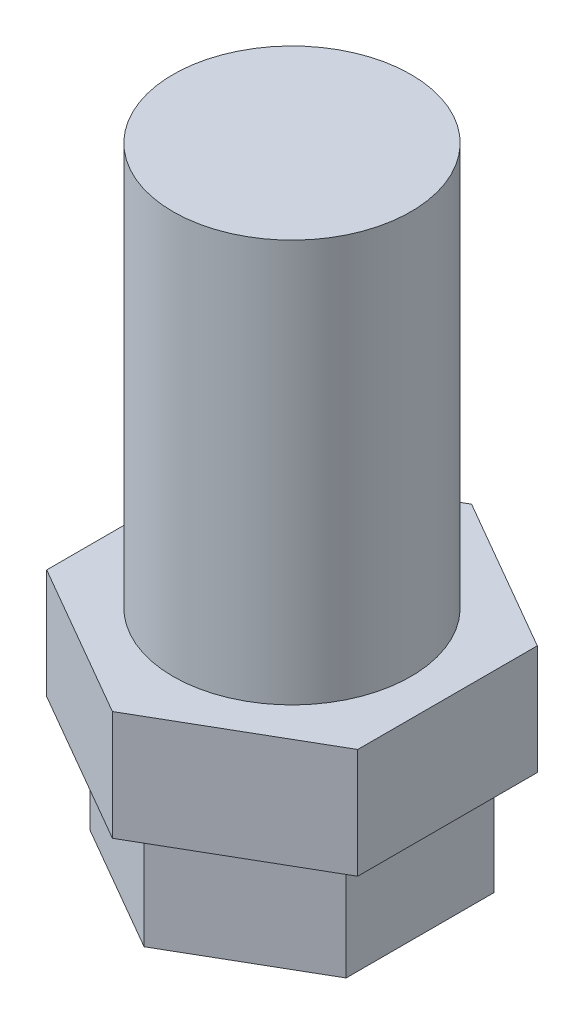
ISO-10303-21;
HEADER;
FILE_DESCRIPTION(('STEP AP214'),'2;1');
FILE_NAME('part.step','',(''),(''),'','','');
FILE_SCHEMA(('AUTOMOTIVE_DESIGN { 1 0 10303 214 1 1 1 1 }'));
ENDSEC;
DATA;
#1=APPLICATION_CONTEXT('core data for automotive mechanical design processes');
#2=APPLICATION_PROTOCOL_DEFINITION('international standard','automotive_design',2000,#1);
#3=PRODUCT_CONTEXT('',#1,'mechanical');
#4=PRODUCT('Part','Part','',(#3));
#5=PRODUCT_RELATED_PRODUCT_CATEGORY('part','',(#4));
#6=PRODUCT_DEFINITION_FORMATION('','',#4);
#7=PRODUCT_DEFINITION_CONTEXT('part definition',#1,'design');
#8=PRODUCT_DEFINITION('design','',#6,#7);
#9=PRODUCT_DEFINITION_SHAPE('','',#8);
#10=(LENGTH_UNIT() NAMED_UNIT(*) SI_UNIT(.MILLI.,.METRE.));
#11=(NAMED_UNIT(*) PLANE_ANGLE_UNIT() SI_UNIT($,.RADIAN.));
#12=(NAMED_UNIT(*) SI_UNIT($,.STERADIAN.) SOLID_ANGLE_UNIT());
#13=UNCERTAINTY_MEASURE_WITH_UNIT(LENGTH_MEASURE(1.E-05),#10,'distance_accuracy_value','');
#14=(GEOMETRIC_REPRESENTATION_CONTEXT(3) GLOBAL_UNCERTAINTY_ASSIGNED_CONTEXT((#13)) GLOBAL_UNIT_ASSIGNED_CONTEXT((#10,
#11,#12)) REPRESENTATION_CONTEXT('',''));
#15=CARTESIAN_POINT('',(0.,0.,0.));
#16=DIRECTION('',(0.,0.,1.));
#17=DIRECTION('',(1.,0.,0.));
#18=AXIS2_PLACEMENT_3D('',#15,#16,#17);
#19=CARTESIAN_POINT('',(-5.66056250653227E-05,39.3810771161219,5.49030475094835E-11));
#20=DIRECTION('',(1.43738133160636E-06,-0.999999999998967,-1.3941479393145E-12));
#21=DIRECTION('',(0.999999999998967,1.43738133160636E-06,0.));
#22=AXIS2_PLACEMENT_3D('',#19,#20,#21);
#23=PLANE('',#22);
#24=DIRECTION('',(-0.866025403783546,-1.24480944517059E-06,0.5));
#25=VECTOR('',#24,1.);
#26=CARTESIAN_POINT('',(176.249913797421,39.3813304544609,56.0321742847801));
#27=LINE('',#26,#25);
#28=CARTESIAN_POINT('',(176.249913797421,39.3813304544609,56.0321742847801));
#29=VERTEX_POINT('',#28);
#30=CARTESIAN_POINT('',(171.999913797425,39.3813243455868,58.485912928836));
#31=VERTEX_POINT('',#30);
#32=EDGE_CURVE('E116',#29,#31,#27,.T.);
#33=ORIENTED_EDGE('',*,*,#32,.F.);
#34=DIRECTION('',(0.,-1.39414794762809E-12,1.));
#35=VECTOR('',#34,1.);
#36=CARTESIAN_POINT('',(176.249913797421,39.3813304544678,51.1246969966684));
#37=LINE('',#36,#35);
#38=CARTESIAN_POINT('',(176.249913797421,39.3813304544678,51.1246969966685));
#39=VERTEX_POINT('',#38);
#40=EDGE_CURVE('E126',#39,#29,#37,.T.);
#41=ORIENTED_EDGE('',*,*,#40,.F.);
#42=DIRECTION('',(0.866025403783548,1.2448080496087E-06,0.499999999999994));
#43=VECTOR('',#42,1.);
#44=CARTESIAN_POINT('',(171.999913797425,39.3813243456006,48.6709583526126));
#45=LINE('',#44,#43);
#46=CARTESIAN_POINT('',(171.999913797425,39.3813243456006,48.6709583526125));
#47=VERTEX_POINT('',#46);
#48=EDGE_CURVE('E70',#47,#39,#45,.T.);
#49=ORIENTED_EDGE('',*,*,#48,.F.);
#50=DIRECTION('',(0.866025403783544,1.2448094451706E-06,-0.5));
#51=VECTOR('',#50,1.);
#52=CARTESIAN_POINT('',(167.74991379743,39.3813182367265,51.1246969966684));
#53=LINE('',#52,#51);
#54=CARTESIAN_POINT('',(167.74991379743,39.3813182367265,51.124696996668));
#55=VERTEX_POINT('',#54);
#56=EDGE_CURVE('E123',#55,#47,#53,.T.);
#57=ORIENTED_EDGE('',*,*,#56,.F.);
#58=DIRECTION('',(0.,1.39273400447633E-12,-1.));
#59=VECTOR('',#58,1.);
#60=CARTESIAN_POINT('',(167.74991379743,39.3813182367196,56.0321742847798));
#61=LINE('',#60,#59);
#62=CARTESIAN_POINT('',(167.74991379743,39.3813182367196,56.0321742847801));
#63=VERTEX_POINT('',#62);
#64=EDGE_CURVE('E104',#63,#55,#61,.T.);
#65=ORIENTED_EDGE('',*,*,#64,.F.);
#66=DIRECTION('',(-0.866025403783545,-1.24480805102265E-06,-0.5));
#67=VECTOR('',#66,1.);
#68=CARTESIAN_POINT('',(171.999913797425,39.3813243455868,58.485912928836));
#69=LINE('',#68,#67);
#70=EDGE_CURVE('E119',#31,#63,#69,.T.);
#71=ORIENTED_EDGE('',*,*,#70,.F.);
#72=EDGE_LOOP('',(#33,#41,#49,#57,#65,#71));
#73=FACE_BOUND('',#72,.T.);
#74=CARTESIAN_POINT('',(171.999913797425,39.3813243486702,53.5784356407242));
#75=DIRECTION('',(-1.43738133160636E-06,0.999999999998967,1.39414793936096E-12));
#76=DIRECTION('',(0.,1.39414793957272E-12,-1.));
#77=AXIS2_PLACEMENT_3D('',#74,#75,#76);
#78=CIRCLE('',#77,3.25);
#79=CARTESIAN_POINT('',(171.999913797425,39.3813243486748,50.3284356407242));
#80=VERTEX_POINT('',#79);
#81=EDGE_CURVE('E11',#80,#80,#78,.T.);
#82=ORIENTED_EDGE('',*,*,#81,.F.);
#83=EDGE_LOOP('',(#82));
#84=FACE_BOUND('',#83,.T.);
#85=ADVANCED_FACE('F17',(#73,#84),#23,.F.);
#86=CARTESIAN_POINT('',(-5.22934810733301E-05,36.381077116125,5.07209228912537E-11));
#87=DIRECTION('',(1.43738133160636E-06,-0.999999999998967,-1.3941479393145E-12));
#88=DIRECTION('',(0.999999999998967,1.43738133160636E-06,0.));
#89=AXIS2_PLACEMENT_3D('',#86,#87,#88);
#90=PLANE('',#89);
#91=DIRECTION('',(-0.866025403783546,-1.24480944517059E-06,0.5));
#92=VECTOR('',#91,1.);
#93=CARTESIAN_POINT('',(176.249918109565,36.3813304544641,56.0321742847759));
#94=LINE('',#93,#92);
#95=CARTESIAN_POINT('',(176.249918109565,36.3813304544641,56.0321742847759));
#96=VERTEX_POINT('',#95);
#97=CARTESIAN_POINT('',(171.999918109569,36.3813243455899,58.4859129288318));
#98=VERTEX_POINT('',#97);
#99=EDGE_CURVE('E128',#96,#98,#94,.T.);
#100=ORIENTED_EDGE('',*,*,#99,.T.);
#101=DIRECTION('',(-0.866025403783545,-1.24480805102265E-06,-0.5));
#102=VECTOR('',#101,1.);
#103=CARTESIAN_POINT('',(171.999918109569,36.3813243455899,58.4859129288319));
#104=LINE('',#103,#102);
#105=CARTESIAN_POINT('',(167.749918109574,36.3813182367227,56.032174284776));
#106=VERTEX_POINT('',#105);
#107=EDGE_CURVE('E95',#98,#106,#104,.T.);
#108=ORIENTED_EDGE('',*,*,#107,.T.);
#109=DIRECTION('',(0.,1.39273400447633E-12,-1.));
#110=VECTOR('',#109,1.);
#111=CARTESIAN_POINT('',(167.749918109574,36.3813182367227,56.0321742847756));
#112=LINE('',#111,#110);
#113=CARTESIAN_POINT('',(167.749918109574,36.3813182367295,51.1246969966638));
#114=VERTEX_POINT('',#113);
#115=EDGE_CURVE('E88',#106,#114,#112,.T.);
#116=ORIENTED_EDGE('',*,*,#115,.T.);
#117=DIRECTION('',(0.866025403783544,1.2448094451706E-06,-0.5));
#118=VECTOR('',#117,1.);
#119=CARTESIAN_POINT('',(167.749918109574,36.3813182367295,51.1246969966642));
#120=LINE('',#119,#118);
#121=CARTESIAN_POINT('',(171.999918109569,36.3813243456037,48.6709583526083));
#122=VERTEX_POINT('',#121);
#123=EDGE_CURVE('E93',#114,#122,#120,.T.);
#124=ORIENTED_EDGE('',*,*,#123,.T.);
#125=DIRECTION('',(0.866025403783548,1.2448080496087E-06,0.499999999999994));
#126=VECTOR('',#125,1.);
#127=CARTESIAN_POINT('',(171.999918109569,36.3813243456037,48.6709583526084));
#128=LINE('',#127,#126);
#129=CARTESIAN_POINT('',(176.249918109565,36.3813304544709,51.1246969966643));
#130=VERTEX_POINT('',#129);
#131=EDGE_CURVE('E43',#122,#130,#128,.T.);
#132=ORIENTED_EDGE('',*,*,#131,.T.);
#133=DIRECTION('',(0.,-1.39414794762809E-12,1.));
#134=VECTOR('',#133,1.);
#135=CARTESIAN_POINT('',(176.249918109565,36.3813304544709,51.1246969966642));
#136=LINE('',#135,#134);
#137=EDGE_CURVE('E76',#130,#96,#136,.T.);
#138=ORIENTED_EDGE('',*,*,#137,.T.);
#139=EDGE_LOOP('',(#100,#108,#116,#124,#132,#138));
#140=FACE_BOUND('',#139,.T.);
#141=DIRECTION('',(0.866025403783546,1.24480805395153E-06,0.5));
#142=VECTOR('',#141,1.);
#143=CARTESIAN_POINT('',(168.499918109573,36.3813193147592,55.5991615828838));
#144=LINE('',#143,#142);
#145=CARTESIAN_POINT('',(168.499918109573,36.3813193147592,55.5991615828834));
#146=VERTEX_POINT('',#145);
#147=CARTESIAN_POINT('',(171.999918109569,36.381324345591,57.6198875250474));
#148=VERTEX_POINT('',#147);
#149=EDGE_CURVE('E164',#146,#148,#144,.T.);
#150=ORIENTED_EDGE('',*,*,#149,.T.);
#151=DIRECTION('',(0.866025403783545,1.24480944466561E-06,-0.5));
#152=VECTOR('',#151,1.);
#153=CARTESIAN_POINT('',(171.999918109569,36.381324345591,57.6198875250474));
#154=LINE('',#153,#152);
#155=CARTESIAN_POINT('',(175.499918109565,36.3813293764285,55.5991615828837));
#156=VERTEX_POINT('',#155);
#157=EDGE_CURVE('E34',#148,#156,#154,.T.);
#158=ORIENTED_EDGE('',*,*,#157,.T.);
#159=DIRECTION('',(0.,1.39414794762808E-12,-1.));
#160=VECTOR('',#159,1.);
#161=CARTESIAN_POINT('',(175.499918109565,36.3813293764285,55.5991615828838));
#162=LINE('',#161,#160);
#163=CARTESIAN_POINT('',(175.499918109565,36.3813293764341,51.5577096985564));
#164=VERTEX_POINT('',#163);
#165=EDGE_CURVE('E177',#156,#164,#162,.T.);
#166=ORIENTED_EDGE('',*,*,#165,.T.);
#167=DIRECTION('',(-0.866025403783548,-1.24480805051767E-06,-0.499999999999993));
#168=VECTOR('',#167,1.);
#169=CARTESIAN_POINT('',(175.499918109565,36.3813293764341,51.5577096985564));
#170=LINE('',#169,#168);
#171=CARTESIAN_POINT('',(171.999918109569,36.3813243456023,49.5369837563928));
#172=VERTEX_POINT('',#171);
#173=EDGE_CURVE('E174',#164,#172,#170,.T.);
#174=ORIENTED_EDGE('',*,*,#173,.T.);
#175=DIRECTION('',(-0.866025403783544,-1.24480944981641E-06,0.5));
#176=VECTOR('',#175,1.);
#177=CARTESIAN_POINT('',(171.999918109569,36.3813243456023,49.5369837563927));
#178=LINE('',#177,#176);
#179=CARTESIAN_POINT('',(168.499918109573,36.3813193147648,51.5577096985564));
#180=VERTEX_POINT('',#179);
#181=EDGE_CURVE('E171',#172,#180,#178,.T.);
#182=ORIENTED_EDGE('',*,*,#181,.T.);
#183=DIRECTION('',(0.,-1.39586487859807E-12,1.));
#184=VECTOR('',#183,1.);
#185=CARTESIAN_POINT('',(168.499918109573,36.3813193147648,51.557709698556));
#186=LINE('',#185,#184);
#187=EDGE_CURVE('E168',#180,#146,#186,.T.);
#188=ORIENTED_EDGE('',*,*,#187,.T.);
#189=EDGE_LOOP('',(#150,#158,#166,#174,#182,#188));
#190=FACE_BOUND('',#189,.T.);
#191=ADVANCED_FACE('F90',(#140,#190),#90,.T.);
#192=CARTESIAN_POINT('',(176.249918109565,36.3813304544641,56.0321742847759));
#193=DIRECTION('',(-0.499999999999479,-7.1868945805671E-07,-0.866025403784441));
#194=DIRECTION('',(-0.866025403784665,0.,0.499999999999609));
#195=AXIS2_PLACEMENT_3D('',#192,#193,#194);
#196=PLANE('',#195);
#197=ORIENTED_EDGE('',*,*,#32,.T.);
#198=DIRECTION('',(-1.43738133066421E-06,0.999999999998967,1.39404153940994E-12));
#199=VECTOR('',#198,1.);
#200=CARTESIAN_POINT('',(171.999918109569,36.3813243455899,58.4859129288318));
#201=LINE('',#200,#199);
#202=EDGE_CURVE('E26',#98,#31,#201,.T.);
#203=ORIENTED_EDGE('',*,*,#202,.F.);
#204=ORIENTED_EDGE('',*,*,#99,.F.);
#205=DIRECTION('',(-1.43738133066421E-06,0.999999999998967,1.39404153940994E-12));
#206=VECTOR('',#205,1.);
#207=CARTESIAN_POINT('',(176.249918109565,36.3813304544641,56.0321742847759));
#208=LINE('',#207,#206);
#209=EDGE_CURVE('E21',#96,#29,#208,.T.);
#210=ORIENTED_EDGE('',*,*,#209,.T.);
#211=EDGE_LOOP('',(#197,#203,#204,#210));
#212=FACE_BOUND('',#211,.T.);
#213=ADVANCED_FACE('F19',(#212),#196,.F.);
#214=CARTESIAN_POINT('',(171.999918109569,36.3813243455899,58.4859129288319));
#215=DIRECTION('',(0.499999999999482,7.18691872607488E-07,-0.86602540378444));
#216=DIRECTION('',(-0.866025403784663,0.,-0.499999999999611));
#217=AXIS2_PLACEMENT_3D('',#214,#215,#216);
#218=PLANE('',#217);
#219=ORIENTED_EDGE('',*,*,#70,.T.);
#220=DIRECTION('',(-1.43738133066421E-06,0.999999999998967,1.39404153940994E-12));
#221=VECTOR('',#220,1.);
#222=CARTESIAN_POINT('',(167.749918109574,36.3813182367227,56.032174284776));
#223=LINE('',#222,#221);
#224=EDGE_CURVE('E107',#106,#63,#223,.T.);
#225=ORIENTED_EDGE('',*,*,#224,.F.);
#226=ORIENTED_EDGE('',*,*,#107,.F.);
#227=ORIENTED_EDGE('',*,*,#202,.T.);
#228=EDGE_LOOP('',(#219,#225,#226,#227));
#229=FACE_BOUND('',#228,.T.);
#230=ADVANCED_FACE('F135',(#229),#218,.F.);
#231=CARTESIAN_POINT('',(167.749918109574,36.3813182367227,56.0321742847756));
#232=DIRECTION('',(0.999999999998967,1.43738133066421E-06,0.));
#233=DIRECTION('',(-1.43738133066421E-06,0.999999999998967,0.));
#234=AXIS2_PLACEMENT_3D('',#231,#232,#233);
#235=PLANE('',#234);
#236=ORIENTED_EDGE('',*,*,#64,.T.);
#237=DIRECTION('',(-1.43738133066421E-06,0.999999999998967,1.39404153940994E-12));
#238=VECTOR('',#237,1.);
#239=CARTESIAN_POINT('',(167.749918109574,36.3813182367295,51.1246969966638));
#240=LINE('',#239,#238);
#241=EDGE_CURVE('E101',#114,#55,#240,.T.);
#242=ORIENTED_EDGE('',*,*,#241,.F.);
#243=ORIENTED_EDGE('',*,*,#115,.F.);
#244=ORIENTED_EDGE('',*,*,#224,.T.);
#245=EDGE_LOOP('',(#236,#242,#243,#244));
#246=FACE_BOUND('',#245,.T.);
#247=ADVANCED_FACE('F102',(#246),#235,.F.);
#248=CARTESIAN_POINT('',(167.749918109574,36.3813182367295,51.1246969966642));
#249=DIRECTION('',(0.499999999999484,7.18689458056717E-07,0.866025403784438));
#250=DIRECTION('',(0.866025403784662,0.,-0.499999999999613));
#251=AXIS2_PLACEMENT_3D('',#248,#249,#250);
#252=PLANE('',#251);
#253=ORIENTED_EDGE('',*,*,#56,.T.);
#254=DIRECTION('',(-1.43738133066421E-06,0.999999999998967,1.39404153940994E-12));
#255=VECTOR('',#254,1.);
#256=CARTESIAN_POINT('',(171.999918109569,36.3813243456037,48.6709583526083));
#257=LINE('',#256,#255);
#258=EDGE_CURVE('E108',#122,#47,#257,.T.);
#259=ORIENTED_EDGE('',*,*,#258,.F.);
#260=ORIENTED_EDGE('',*,*,#123,.F.);
#261=ORIENTED_EDGE('',*,*,#241,.T.);
#262=EDGE_LOOP('',(#253,#259,#260,#261));
#263=FACE_BOUND('',#262,.T.);
#264=ADVANCED_FACE('F110',(#263),#252,.F.);
#265=CARTESIAN_POINT('',(171.999918109569,36.3813243456037,48.6709583526084));
#266=DIRECTION('',(-0.499999999999477,-7.18691872607482E-07,0.866025403784442));
#267=DIRECTION('',(0.866025403784666,0.,0.499999999999606));
#268=AXIS2_PLACEMENT_3D('',#265,#266,#267);
#269=PLANE('',#268);
#270=ORIENTED_EDGE('',*,*,#48,.T.);
#271=DIRECTION('',(-1.43738133066421E-06,0.999999999998967,1.39404153940994E-12));
#272=VECTOR('',#271,1.);
#273=CARTESIAN_POINT('',(176.249918109565,36.3813304544709,51.1246969966643));
#274=LINE('',#273,#272);
#275=EDGE_CURVE('E129',#130,#39,#274,.T.);
#276=ORIENTED_EDGE('',*,*,#275,.F.);
#277=ORIENTED_EDGE('',*,*,#131,.F.);
#278=ORIENTED_EDGE('',*,*,#258,.T.);
#279=EDGE_LOOP('',(#270,#276,#277,#278));
#280=FACE_BOUND('',#279,.T.);
#281=ADVANCED_FACE('F143',(#280),#269,.F.);
#282=CARTESIAN_POINT('',(176.249918109565,36.3813304544709,51.1246969966642));
#283=DIRECTION('',(-0.999999999998967,-1.43738133066421E-06,0.));
#284=DIRECTION('',(1.43738133066421E-06,-0.999999999998967,0.));
#285=AXIS2_PLACEMENT_3D('',#282,#283,#284);
#286=PLANE('',#285);
#287=ORIENTED_EDGE('',*,*,#40,.T.);
#288=ORIENTED_EDGE('',*,*,#209,.F.);
#289=ORIENTED_EDGE('',*,*,#137,.F.);
#290=ORIENTED_EDGE('',*,*,#275,.T.);
#291=EDGE_LOOP('',(#287,#288,#289,#290));
#292=FACE_BOUND('',#291,.T.);
#293=ADVANCED_FACE('F145',(#292),#286,.F.);
#294=CARTESIAN_POINT('',(171.999922421713,33.3813243455941,57.6198875250433));
#295=DIRECTION('',(0.499999999999482,7.18689458056714E-07,0.86602540378444));
#296=DIRECTION('',(0.866025403784663,0.,-0.499999999999611));
#297=AXIS2_PLACEMENT_3D('',#294,#295,#296);
#298=PLANE('',#297);
#299=ORIENTED_EDGE('',*,*,#157,.F.);
#300=DIRECTION('',(-1.43738133066421E-06,0.999999999998967,1.39404153940994E-12));
#301=VECTOR('',#300,1.);
#302=CARTESIAN_POINT('',(171.999922421713,33.3813243455941,57.6198875250433));
#303=LINE('',#302,#301);
#304=CARTESIAN_POINT('',(171.999922421713,33.3813243455941,57.6198875250433));
#305=VERTEX_POINT('',#304);
#306=EDGE_CURVE('E148',#305,#148,#303,.T.);
#307=ORIENTED_EDGE('',*,*,#306,.F.);
#308=DIRECTION('',(0.866025403783545,1.24480944466561E-06,-0.5));
#309=VECTOR('',#308,1.);
#310=CARTESIAN_POINT('',(171.999922421713,33.3813243455941,57.6198875250433));
#311=LINE('',#310,#309);
#312=CARTESIAN_POINT('',(175.499922421709,33.3813293764316,55.5991615828796));
#313=VERTEX_POINT('',#312);
#314=EDGE_CURVE('E167',#305,#313,#311,.T.);
#315=ORIENTED_EDGE('',*,*,#314,.T.);
#316=DIRECTION('',(-1.43738133066421E-06,0.999999999998967,1.39404153940994E-12));
#317=VECTOR('',#316,1.);
#318=CARTESIAN_POINT('',(175.499922421709,33.3813293764316,55.5991615828796));
#319=LINE('',#318,#317);
#320=EDGE_CURVE('E120',#313,#156,#319,.T.);
#321=ORIENTED_EDGE('',*,*,#320,.T.);
#322=EDGE_LOOP('',(#299,#307,#315,#321));
#323=FACE_BOUND('',#322,.T.);
#324=ADVANCED_FACE('F220',(#323),#298,.T.);
#325=CARTESIAN_POINT('',(175.499922421709,33.3813293764316,55.5991615828796));
#326=DIRECTION('',(0.999999999998967,1.43738133066421E-06,0.));
#327=DIRECTION('',(-1.43738133066421E-06,0.999999999998967,0.));
#328=AXIS2_PLACEMENT_3D('',#325,#326,#327);
#329=PLANE('',#328);
#330=ORIENTED_EDGE('',*,*,#165,.F.);
#331=ORIENTED_EDGE('',*,*,#320,.F.);
#332=DIRECTION('',(0.,1.39414794762808E-12,-1.));
#333=VECTOR('',#332,1.);
#334=CARTESIAN_POINT('',(175.499922421709,33.3813293764316,55.5991615828796));
#335=LINE('',#334,#333);
#336=CARTESIAN_POINT('',(175.499922421709,33.3813293764372,51.5577096985522));
#337=VERTEX_POINT('',#336);
#338=EDGE_CURVE('E193',#313,#337,#335,.T.);
#339=ORIENTED_EDGE('',*,*,#338,.T.);
#340=DIRECTION('',(-1.43738133066421E-06,0.999999999998967,1.39404153940994E-12));
#341=VECTOR('',#340,1.);
#342=CARTESIAN_POINT('',(175.499922421709,33.3813293764372,51.5577096985522));
#343=LINE('',#342,#341);
#344=EDGE_CURVE('E153',#337,#164,#343,.T.);
#345=ORIENTED_EDGE('',*,*,#344,.T.);
#346=EDGE_LOOP('',(#330,#331,#339,#345));
#347=FACE_BOUND('',#346,.T.);
#348=ADVANCED_FACE('F282',(#347),#329,.T.);
#349=CARTESIAN_POINT('',(175.499922421709,33.3813293764372,51.5577096985522));
#350=DIRECTION('',(0.499999999999477,7.18691872607481E-07,-0.866025403784442));
#351=DIRECTION('',(-0.866025403784666,0.,-0.499999999999606));
#352=AXIS2_PLACEMENT_3D('',#349,#350,#351);
#353=PLANE('',#352);
#354=ORIENTED_EDGE('',*,*,#173,.F.);
#355=ORIENTED_EDGE('',*,*,#344,.F.);
#356=DIRECTION('',(-0.866025403783548,-1.24480805051767E-06,-0.499999999999993));
#357=VECTOR('',#356,1.);
#358=CARTESIAN_POINT('',(175.499922421709,33.3813293764372,51.5577096985522));
#359=LINE('',#358,#357);
#360=CARTESIAN_POINT('',(171.999922421713,33.3813243456054,49.5369837563886));
#361=VERTEX_POINT('',#360);
#362=EDGE_CURVE('E190',#337,#361,#359,.T.);
#363=ORIENTED_EDGE('',*,*,#362,.T.);
#364=DIRECTION('',(-1.43738133066421E-06,0.999999999998967,1.39404153940994E-12));
#365=VECTOR('',#364,1.);
#366=CARTESIAN_POINT('',(171.999922421713,33.3813243456054,49.5369837563886));
#367=LINE('',#366,#365);
#368=EDGE_CURVE('E156',#361,#172,#367,.T.);
#369=ORIENTED_EDGE('',*,*,#368,.T.);
#370=EDGE_LOOP('',(#354,#355,#363,#369));
#371=FACE_BOUND('',#370,.T.);
#372=ADVANCED_FACE('F289',(#371),#353,.T.);
#373=CARTESIAN_POINT('',(171.999922421713,33.3813243456054,49.5369837563885));
#374=DIRECTION('',(-0.499999999999483,-7.18689458056716E-07,-0.866025403784439));
#375=DIRECTION('',(-0.866025403784662,0.,0.499999999999613));
#376=AXIS2_PLACEMENT_3D('',#373,#374,#375);
#377=PLANE('',#376);
#378=ORIENTED_EDGE('',*,*,#181,.F.);
#379=ORIENTED_EDGE('',*,*,#368,.F.);
#380=DIRECTION('',(-0.866025403783544,-1.24480944981641E-06,0.5));
#381=VECTOR('',#380,1.);
#382=CARTESIAN_POINT('',(171.999922421713,33.3813243456054,49.5369837563885));
#383=LINE('',#382,#381);
#384=CARTESIAN_POINT('',(168.499922421716,33.3813193147679,51.5577096985522));
#385=VERTEX_POINT('',#384);
#386=EDGE_CURVE('E187',#361,#385,#383,.T.);
#387=ORIENTED_EDGE('',*,*,#386,.T.);
#388=DIRECTION('',(-1.43738133066421E-06,0.999999999998967,1.39404153940994E-12));
#389=VECTOR('',#388,1.);
#390=CARTESIAN_POINT('',(168.499922421716,33.3813193147679,51.5577096985522));
#391=LINE('',#390,#389);
#392=EDGE_CURVE('E159',#385,#180,#391,.T.);
#393=ORIENTED_EDGE('',*,*,#392,.T.);
#394=EDGE_LOOP('',(#378,#379,#387,#393));
#395=FACE_BOUND('',#394,.T.);
#396=ADVANCED_FACE('F298',(#395),#377,.T.);
#397=CARTESIAN_POINT('',(168.499922421717,33.3813193147679,51.5577096985518));
#398=DIRECTION('',(-0.999999999998967,-1.43738133066421E-06,0.));
#399=DIRECTION('',(1.43738133066421E-06,-0.999999999998967,0.));
#400=AXIS2_PLACEMENT_3D('',#397,#398,#399);
#401=PLANE('',#400);
#402=ORIENTED_EDGE('',*,*,#187,.F.);
#403=ORIENTED_EDGE('',*,*,#392,.F.);
#404=DIRECTION('',(0.,-1.39586487859807E-12,1.));
#405=VECTOR('',#404,1.);
#406=CARTESIAN_POINT('',(168.499922421717,33.3813193147679,51.5577096985518));
#407=LINE('',#406,#405);
#408=CARTESIAN_POINT('',(168.499922421717,33.3813193147622,55.5991615828792));
#409=VERTEX_POINT('',#408);
#410=EDGE_CURVE('E184',#385,#409,#407,.T.);
#411=ORIENTED_EDGE('',*,*,#410,.T.);
#412=DIRECTION('',(-1.43738133066421E-06,0.999999999998967,1.39404153940994E-12));
#413=VECTOR('',#412,1.);
#414=CARTESIAN_POINT('',(168.499922421717,33.3813193147622,55.5991615828792));
#415=LINE('',#414,#413);
#416=EDGE_CURVE('E150',#409,#146,#415,.T.);
#417=ORIENTED_EDGE('',*,*,#416,.T.);
#418=EDGE_LOOP('',(#402,#403,#411,#417));
#419=FACE_BOUND('',#418,.T.);
#420=ADVANCED_FACE('F307',(#419),#401,.T.);
#421=CARTESIAN_POINT('',(168.499922421716,33.3813193147622,55.5991615828796));
#422=DIRECTION('',(-0.49999999999948,-7.18691872607485E-07,0.866025403784441));
#423=DIRECTION('',(0.866025403784665,0.,0.499999999999609));
#424=AXIS2_PLACEMENT_3D('',#421,#422,#423);
#425=PLANE('',#424);
#426=ORIENTED_EDGE('',*,*,#149,.F.);
#427=ORIENTED_EDGE('',*,*,#416,.F.);
#428=DIRECTION('',(0.866025403783546,1.24480805395153E-06,0.5));
#429=VECTOR('',#428,1.);
#430=CARTESIAN_POINT('',(168.499922421716,33.3813193147622,55.5991615828796));
#431=LINE('',#430,#429);
#432=EDGE_CURVE('E151',#409,#305,#431,.T.);
#433=ORIENTED_EDGE('',*,*,#432,.T.);
#434=ORIENTED_EDGE('',*,*,#306,.T.);
#435=EDGE_LOOP('',(#426,#427,#433,#434));
#436=FACE_BOUND('',#435,.T.);
#437=ADVANCED_FACE('F316',(#436),#425,.T.);
#438=CARTESIAN_POINT('',(-4.79813370572972E-05,33.3810771161281,4.65384793757148E-11));
#439=DIRECTION('',(-1.43738133102327E-06,0.999999999998967,1.39414794762664E-12));
#440=DIRECTION('',(-0.999999999998967,-1.43738133102327E-06,0.));
#441=AXIS2_PLACEMENT_3D('',#438,#439,#440);
#442=PLANE('',#441);
#443=ORIENTED_EDGE('',*,*,#314,.F.);
#444=ORIENTED_EDGE('',*,*,#432,.F.);
#445=ORIENTED_EDGE('',*,*,#410,.F.);
#446=ORIENTED_EDGE('',*,*,#386,.F.);
#447=ORIENTED_EDGE('',*,*,#362,.F.);
#448=ORIENTED_EDGE('',*,*,#338,.F.);
#449=EDGE_LOOP('',(#443,#444,#445,#446,#447,#448));
#450=FACE_BOUND('',#449,.T.);
#451=ADVANCED_FACE('F206',(#450),#442,.F.);
#452=CARTESIAN_POINT('',(171.999897986231,50.3813243486589,53.5784356407395));
#453=DIRECTION('',(1.43738133160636E-06,-0.999999999998967,-1.3941479393145E-12));
#454=DIRECTION('',(0.999999999998967,1.43738133160636E-06,0.));
#455=AXIS2_PLACEMENT_3D('',#452,#453,#454);
#456=CYLINDRICAL_SURFACE('',#455,3.25);
#457=CARTESIAN_POINT('',(171.999897986231,50.3813243486589,53.5784356407395));
#458=DIRECTION('',(-1.43738133160636E-06,0.999999999998967,1.39414793936096E-12));
#459=DIRECTION('',(0.,1.39414793957272E-12,-1.));
#460=AXIS2_PLACEMENT_3D('',#457,#458,#459);
#461=CIRCLE('',#460,3.25);
#462=CARTESIAN_POINT('',(171.999897986231,50.3813243486634,50.3284356407395));
#463=VERTEX_POINT('',#462);
#464=EDGE_CURVE('E181',#463,#463,#461,.T.);
#465=ORIENTED_EDGE('',*,*,#464,.F.);
#466=EDGE_LOOP('',(#465));
#467=FACE_BOUND('',#466,.T.);
#468=ORIENTED_EDGE('',*,*,#81,.T.);
#469=EDGE_LOOP('',(#468));
#470=FACE_BOUND('',#469,.T.);
#471=ADVANCED_FACE('F203',(#467,#470),#456,.T.);
#472=CARTESIAN_POINT('',(171.999897986231,50.3813243486589,53.5784356407395));
#473=DIRECTION('',(-1.43738133160636E-06,0.999999999998967,1.39414793936096E-12));
#474=DIRECTION('',(-0.999999999998967,-1.43738133160636E-06,0.));
#475=AXIS2_PLACEMENT_3D('',#472,#473,#474);
#476=PLANE('',#475);
#477=ORIENTED_EDGE('',*,*,#464,.T.);
#478=EDGE_LOOP('',(#477));
#479=FACE_BOUND('',#478,.T.);
#480=ADVANCED_FACE('F201',(#479),#476,.T.);
#481=CLOSED_SHELL('',(#85,#191,#213,#230,#247,#264,#281,#293,#324,#348,#372,#396,#420,#437,#451,
#471,#480));
#482=MANIFOLD_SOLID_BREP('B1',#481);
#483=ADVANCED_BREP_SHAPE_REPRESENTATION('',(#18,#482),#14);
#484=SHAPE_DEFINITION_REPRESENTATION(#9,#483);
ENDSEC;
END-ISO-10303-21;
